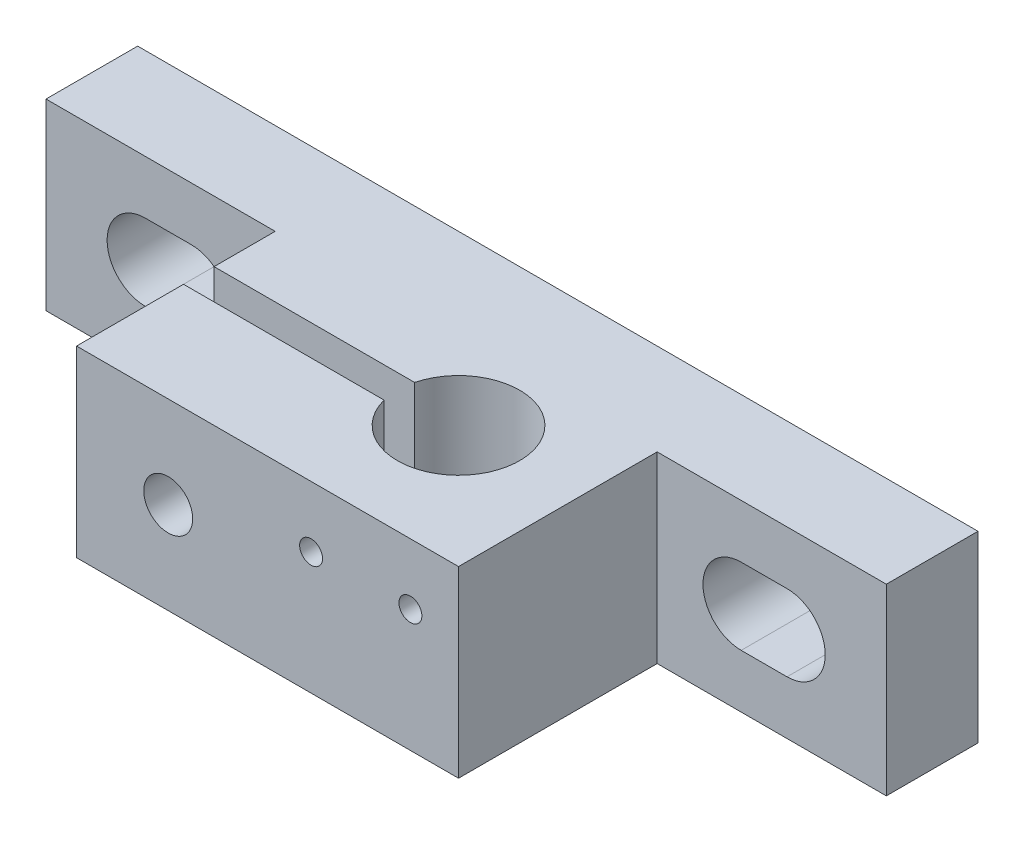
ISO-10303-21;
HEADER;
FILE_DESCRIPTION(('STEP AP214'),'2;1');
FILE_NAME('part.step','',(''),(''),'','','');
FILE_SCHEMA(('AUTOMOTIVE_DESIGN { 1 0 10303 214 1 1 1 1 }'));
ENDSEC;
DATA;
#1=APPLICATION_CONTEXT('core data for automotive mechanical design processes');
#2=APPLICATION_PROTOCOL_DEFINITION('international standard','automotive_design',2000,#1);
#3=PRODUCT_CONTEXT('',#1,'mechanical');
#4=PRODUCT('Part','Part','',(#3));
#5=PRODUCT_RELATED_PRODUCT_CATEGORY('part','',(#4));
#6=PRODUCT_DEFINITION_FORMATION('','',#4);
#7=PRODUCT_DEFINITION_CONTEXT('part definition',#1,'design');
#8=PRODUCT_DEFINITION('design','',#6,#7);
#9=PRODUCT_DEFINITION_SHAPE('','',#8);
#10=(LENGTH_UNIT() NAMED_UNIT(*) SI_UNIT(.MILLI.,.METRE.));
#11=(NAMED_UNIT(*) PLANE_ANGLE_UNIT() SI_UNIT($,.RADIAN.));
#12=(NAMED_UNIT(*) SI_UNIT($,.STERADIAN.) SOLID_ANGLE_UNIT());
#13=UNCERTAINTY_MEASURE_WITH_UNIT(LENGTH_MEASURE(1.E-05),#10,'distance_accuracy_value','');
#14=(GEOMETRIC_REPRESENTATION_CONTEXT(3) GLOBAL_UNCERTAINTY_ASSIGNED_CONTEXT((#13)) GLOBAL_UNIT_ASSIGNED_CONTEXT((#10,
#11,#12)) REPRESENTATION_CONTEXT('',''));
#15=CARTESIAN_POINT('',(0.,0.,0.));
#16=DIRECTION('',(0.,0.,1.));
#17=DIRECTION('',(1.,0.,0.));
#18=AXIS2_PLACEMENT_3D('',#15,#16,#17);
#19=CARTESIAN_POINT('',(15.,0.,19.));
#20=DIRECTION('',(1.,0.,0.));
#21=DIRECTION('',(0.,0.,-1.));
#22=AXIS2_PLACEMENT_3D('',#19,#20,#21);
#23=PLANE('',#22);
#24=DIRECTION('',(0.,0.,-1.));
#25=VECTOR('',#24,1.);
#26=CARTESIAN_POINT('',(15.,0.,19.));
#27=LINE('',#26,#25);
#28=CARTESIAN_POINT('',(15.,0.,10.));
#29=VERTEX_POINT('',#28);
#30=CARTESIAN_POINT('',(15.,0.,6.));
#31=VERTEX_POINT('',#30);
#32=EDGE_CURVE('E375',#29,#31,#27,.T.);
#33=ORIENTED_EDGE('',*,*,#32,.F.);
#34=DIRECTION('',(0.,1.,0.));
#35=VECTOR('',#34,1.);
#36=CARTESIAN_POINT('',(15.,0.,10.));
#37=LINE('',#36,#35);
#38=CARTESIAN_POINT('',(15.,12.,10.));
#39=VERTEX_POINT('',#38);
#40=EDGE_CURVE('E42',#29,#39,#37,.T.);
#41=ORIENTED_EDGE('',*,*,#40,.T.);
#42=DIRECTION('',(0.,0.,-1.));
#43=VECTOR('',#42,1.);
#44=CARTESIAN_POINT('',(15.,12.,19.));
#45=LINE('',#44,#43);
#46=CARTESIAN_POINT('',(15.,12.,6.));
#47=VERTEX_POINT('',#46);
#48=EDGE_CURVE('E358',#39,#47,#45,.T.);
#49=ORIENTED_EDGE('',*,*,#48,.T.);
#50=DIRECTION('',(0.,-1.,0.));
#51=VECTOR('',#50,1.);
#52=CARTESIAN_POINT('',(15.,0.,6.));
#53=LINE('',#52,#51);
#54=EDGE_CURVE('E347',#47,#31,#53,.T.);
#55=ORIENTED_EDGE('',*,*,#54,.T.);
#56=EDGE_LOOP('',(#33,#41,#49,#55));
#57=FACE_BOUND('',#56,.T.);
#58=ADVANCED_FACE('F33',(#57),#23,.F.);
#59=CARTESIAN_POINT('',(0.,0.,6.));
#60=DIRECTION('',(0.,0.,-1.));
#61=DIRECTION('',(-1.,0.,0.));
#62=AXIS2_PLACEMENT_3D('',#59,#60,#61);
#63=PLANE('',#62);
#64=CARTESIAN_POINT('',(6.5,6.,6.));
#65=DIRECTION('',(0.,0.,1.));
#66=DIRECTION('',(1.,0.,0.));
#67=AXIS2_PLACEMENT_3D('',#64,#65,#66);
#68=CIRCLE('',#67,2.50000000000001);
#69=CARTESIAN_POINT('',(6.5,8.5,6.));
#70=VERTEX_POINT('',#69);
#71=CARTESIAN_POINT('',(6.5,3.49999999999999,6.));
#72=VERTEX_POINT('',#71);
#73=EDGE_CURVE('E453',#70,#72,#68,.T.);
#74=ORIENTED_EDGE('',*,*,#73,.F.);
#75=DIRECTION('',(-1.,0.,0.));
#76=VECTOR('',#75,1.);
#77=CARTESIAN_POINT('',(6.5,8.5,6.));
#78=LINE('',#77,#76);
#79=CARTESIAN_POINT('',(9.5,8.5,6.));
#80=VERTEX_POINT('',#79);
#81=EDGE_CURVE('E449',#80,#70,#78,.T.);
#82=ORIENTED_EDGE('',*,*,#81,.F.);
#83=CARTESIAN_POINT('',(9.5,6.,6.));
#84=DIRECTION('',(0.,0.,1.));
#85=DIRECTION('',(1.,0.,0.));
#86=AXIS2_PLACEMENT_3D('',#83,#84,#85);
#87=CIRCLE('',#86,2.50000000000001);
#88=CARTESIAN_POINT('',(9.49999999999999,3.49999999999999,6.));
#89=VERTEX_POINT('',#88);
#90=EDGE_CURVE('E465',#89,#80,#87,.T.);
#91=ORIENTED_EDGE('',*,*,#90,.F.);
#92=DIRECTION('',(1.,0.,0.));
#93=VECTOR('',#92,1.);
#94=CARTESIAN_POINT('',(6.5,3.49999999999999,6.));
#95=LINE('',#94,#93);
#96=EDGE_CURVE('E468',#72,#89,#95,.T.);
#97=ORIENTED_EDGE('',*,*,#96,.F.);
#98=EDGE_LOOP('',(#74,#82,#91,#97));
#99=FACE_BOUND('',#98,.T.);
#100=ORIENTED_EDGE('',*,*,#54,.F.);
#101=DIRECTION('',(-1.,0.,0.));
#102=VECTOR('',#101,1.);
#103=CARTESIAN_POINT('',(0.,12.,6.));
#104=LINE('',#103,#102);
#105=CARTESIAN_POINT('',(0.,12.,6.));
#106=VERTEX_POINT('',#105);
#107=EDGE_CURVE('E394',#47,#106,#104,.T.);
#108=ORIENTED_EDGE('',*,*,#107,.T.);
#109=DIRECTION('',(0.,-1.,0.));
#110=VECTOR('',#109,1.);
#111=CARTESIAN_POINT('',(0.,0.,6.));
#112=LINE('',#111,#110);
#113=CARTESIAN_POINT('',(0.,0.,6.));
#114=VERTEX_POINT('',#113);
#115=EDGE_CURVE('E424',#106,#114,#112,.T.);
#116=ORIENTED_EDGE('',*,*,#115,.T.);
#117=DIRECTION('',(1.,0.,0.));
#118=VECTOR('',#117,1.);
#119=CARTESIAN_POINT('',(0.,0.,6.));
#120=LINE('',#119,#118);
#121=EDGE_CURVE('E404',#114,#31,#120,.T.);
#122=ORIENTED_EDGE('',*,*,#121,.T.);
#123=EDGE_LOOP('',(#100,#108,#116,#122));
#124=FACE_BOUND('',#123,.T.);
#125=ADVANCED_FACE('F534',(#99,#124),#63,.F.);
#126=CARTESIAN_POINT('',(48.5,6.00000000000001,6.));
#127=DIRECTION('',(0.,0.,1.));
#128=DIRECTION('',(-1.,0.,0.));
#129=AXIS2_PLACEMENT_3D('',#126,#127,#128);
#130=CIRCLE('',#129,2.50000000000001);
#131=CARTESIAN_POINT('',(48.5,3.49999999999999,6.));
#132=VERTEX_POINT('',#131);
#133=CARTESIAN_POINT('',(48.5,8.50000000000001,6.));
#134=VERTEX_POINT('',#133);
#135=EDGE_CURVE('E484',#132,#134,#130,.T.);
#136=ORIENTED_EDGE('',*,*,#135,.F.);
#137=DIRECTION('',(1.,0.,0.));
#138=VECTOR('',#137,1.);
#139=CARTESIAN_POINT('',(48.5,3.49999999999999,6.));
#140=LINE('',#139,#138);
#141=CARTESIAN_POINT('',(45.5,3.49999999999999,6.));
#142=VERTEX_POINT('',#141);
#143=EDGE_CURVE('E480',#142,#132,#140,.T.);
#144=ORIENTED_EDGE('',*,*,#143,.F.);
#145=CARTESIAN_POINT('',(45.5,6.,6.));
#146=DIRECTION('',(0.,0.,1.));
#147=DIRECTION('',(-1.,0.,0.));
#148=AXIS2_PLACEMENT_3D('',#145,#146,#147);
#149=CIRCLE('',#148,2.50000000000001);
#150=CARTESIAN_POINT('',(45.5,8.50000000000001,6.));
#151=VERTEX_POINT('',#150);
#152=EDGE_CURVE('E496',#151,#142,#149,.T.);
#153=ORIENTED_EDGE('',*,*,#152,.F.);
#154=DIRECTION('',(-1.,0.,0.));
#155=VECTOR('',#154,1.);
#156=CARTESIAN_POINT('',(48.5,8.50000000000001,6.));
#157=LINE('',#156,#155);
#158=EDGE_CURVE('E499',#134,#151,#157,.T.);
#159=ORIENTED_EDGE('',*,*,#158,.F.);
#160=EDGE_LOOP('',(#136,#144,#153,#159));
#161=FACE_BOUND('',#160,.T.);
#162=DIRECTION('',(0.,1.,0.));
#163=VECTOR('',#162,1.);
#164=CARTESIAN_POINT('',(40.,0.,6.));
#165=LINE('',#164,#163);
#166=CARTESIAN_POINT('',(40.,0.,6.));
#167=VERTEX_POINT('',#166);
#168=CARTESIAN_POINT('',(40.,12.,6.));
#169=VERTEX_POINT('',#168);
#170=EDGE_CURVE('E352',#167,#169,#165,.T.);
#171=ORIENTED_EDGE('',*,*,#170,.F.);
#172=CARTESIAN_POINT('',(55.,0.,6.));
#173=VERTEX_POINT('',#172);
#174=EDGE_CURVE('E435',#167,#173,#120,.T.);
#175=ORIENTED_EDGE('',*,*,#174,.T.);
#176=DIRECTION('',(0.,1.,0.));
#177=VECTOR('',#176,1.);
#178=CARTESIAN_POINT('',(55.,0.,6.));
#179=LINE('',#178,#177);
#180=CARTESIAN_POINT('',(55.,12.,6.));
#181=VERTEX_POINT('',#180);
#182=EDGE_CURVE('E401',#173,#181,#179,.T.);
#183=ORIENTED_EDGE('',*,*,#182,.T.);
#184=EDGE_CURVE('E400',#181,#169,#104,.T.);
#185=ORIENTED_EDGE('',*,*,#184,.T.);
#186=EDGE_LOOP('',(#171,#175,#183,#185));
#187=FACE_BOUND('',#186,.T.);
#188=ADVANCED_FACE('F512',(#161,#187),#63,.F.);
#189=CARTESIAN_POINT('',(0.,0.,0.));
#190=DIRECTION('',(0.,0.,-1.));
#191=DIRECTION('',(-1.,0.,0.));
#192=AXIS2_PLACEMENT_3D('',#189,#190,#191);
#193=PLANE('',#192);
#194=DIRECTION('',(0.,-1.,0.));
#195=VECTOR('',#194,1.);
#196=CARTESIAN_POINT('',(37.6724189772482,9.5,0.));
#197=LINE('',#196,#195);
#198=CARTESIAN_POINT('',(37.6724189772482,9.5,0.));
#199=VERTEX_POINT('',#198);
#200=CARTESIAN_POINT('',(37.6724189772482,2.5,0.));
#201=VERTEX_POINT('',#200);
#202=EDGE_CURVE('E57',#199,#201,#197,.T.);
#203=ORIENTED_EDGE('',*,*,#202,.F.);
#204=DIRECTION('',(1.,0.,0.));
#205=VECTOR('',#204,1.);
#206=CARTESIAN_POINT('',(37.6724189772482,9.5,0.));
#207=LINE('',#206,#205);
#208=CARTESIAN_POINT('',(17.15852847,9.5,0.));
#209=VERTEX_POINT('',#208);
#210=EDGE_CURVE('E303',#209,#199,#207,.T.);
#211=ORIENTED_EDGE('',*,*,#210,.F.);
#212=DIRECTION('',(0.,1.,0.));
#213=VECTOR('',#212,1.);
#214=CARTESIAN_POINT('',(17.15852847,9.5,0.));
#215=LINE('',#214,#213);
#216=CARTESIAN_POINT('',(17.15852847,2.5,0.));
#217=VERTEX_POINT('',#216);
#218=EDGE_CURVE('E317',#217,#209,#215,.T.);
#219=ORIENTED_EDGE('',*,*,#218,.F.);
#220=DIRECTION('',(-1.,0.,0.));
#221=VECTOR('',#220,1.);
#222=CARTESIAN_POINT('',(37.6724189772482,2.5,0.));
#223=LINE('',#222,#221);
#224=EDGE_CURVE('E314',#201,#217,#223,.T.);
#225=ORIENTED_EDGE('',*,*,#224,.F.);
#226=EDGE_LOOP('',(#203,#211,#219,#225));
#227=FACE_BOUND('',#226,.T.);
#228=DIRECTION('',(-1.,0.,0.));
#229=VECTOR('',#228,1.);
#230=CARTESIAN_POINT('',(6.5,8.5,0.));
#231=LINE('',#230,#229);
#232=CARTESIAN_POINT('',(9.5,8.5,0.));
#233=VERTEX_POINT('',#232);
#234=CARTESIAN_POINT('',(6.5,8.5,0.));
#235=VERTEX_POINT('',#234);
#236=EDGE_CURVE('E450',#233,#235,#231,.T.);
#237=ORIENTED_EDGE('',*,*,#236,.T.);
#238=CARTESIAN_POINT('',(6.5,6.,0.));
#239=DIRECTION('',(0.,0.,1.));
#240=DIRECTION('',(1.,0.,0.));
#241=AXIS2_PLACEMENT_3D('',#238,#239,#240);
#242=CIRCLE('',#241,2.50000000000001);
#243=CARTESIAN_POINT('',(6.5,3.49999999999999,0.));
#244=VERTEX_POINT('',#243);
#245=EDGE_CURVE('E460',#235,#244,#242,.T.);
#246=ORIENTED_EDGE('',*,*,#245,.T.);
#247=DIRECTION('',(1.,0.,0.));
#248=VECTOR('',#247,1.);
#249=CARTESIAN_POINT('',(6.5,3.49999999999999,0.));
#250=LINE('',#249,#248);
#251=CARTESIAN_POINT('',(9.49999999999999,3.49999999999999,0.));
#252=VERTEX_POINT('',#251);
#253=EDGE_CURVE('E457',#244,#252,#250,.T.);
#254=ORIENTED_EDGE('',*,*,#253,.T.);
#255=CARTESIAN_POINT('',(9.5,6.,0.));
#256=DIRECTION('',(0.,0.,1.));
#257=DIRECTION('',(1.,0.,0.));
#258=AXIS2_PLACEMENT_3D('',#255,#256,#257);
#259=CIRCLE('',#258,2.50000000000001);
#260=EDGE_CURVE('E454',#252,#233,#259,.T.);
#261=ORIENTED_EDGE('',*,*,#260,.T.);
#262=EDGE_LOOP('',(#237,#246,#254,#261));
#263=FACE_BOUND('',#262,.T.);
#264=DIRECTION('',(0.,-1.,0.));
#265=VECTOR('',#264,1.);
#266=CARTESIAN_POINT('',(0.,0.,0.));
#267=LINE('',#266,#265);
#268=CARTESIAN_POINT('',(0.,12.,0.));
#269=VERTEX_POINT('',#268);
#270=CARTESIAN_POINT('',(0.,0.,0.));
#271=VERTEX_POINT('',#270);
#272=EDGE_CURVE('E413',#269,#271,#267,.T.);
#273=ORIENTED_EDGE('',*,*,#272,.F.);
#274=DIRECTION('',(-1.,0.,0.));
#275=VECTOR('',#274,1.);
#276=CARTESIAN_POINT('',(0.,12.,0.));
#277=LINE('',#276,#275);
#278=CARTESIAN_POINT('',(55.,12.,0.));
#279=VERTEX_POINT('',#278);
#280=EDGE_CURVE('E422',#279,#269,#277,.T.);
#281=ORIENTED_EDGE('',*,*,#280,.F.);
#282=DIRECTION('',(0.,1.,0.));
#283=VECTOR('',#282,1.);
#284=CARTESIAN_POINT('',(55.,0.,0.));
#285=LINE('',#284,#283);
#286=CARTESIAN_POINT('',(55.,0.,0.));
#287=VERTEX_POINT('',#286);
#288=EDGE_CURVE('E420',#287,#279,#285,.T.);
#289=ORIENTED_EDGE('',*,*,#288,.F.);
#290=DIRECTION('',(1.,0.,0.));
#291=VECTOR('',#290,1.);
#292=CARTESIAN_POINT('',(0.,0.,0.));
#293=LINE('',#292,#291);
#294=EDGE_CURVE('E417',#271,#287,#293,.T.);
#295=ORIENTED_EDGE('',*,*,#294,.F.);
#296=EDGE_LOOP('',(#273,#281,#289,#295));
#297=FACE_BOUND('',#296,.T.);
#298=DIRECTION('',(1.,0.,0.));
#299=VECTOR('',#298,1.);
#300=CARTESIAN_POINT('',(48.5,3.49999999999999,0.));
#301=LINE('',#300,#299);
#302=CARTESIAN_POINT('',(45.5,3.5,0.));
#303=VERTEX_POINT('',#302);
#304=CARTESIAN_POINT('',(48.5,3.49999999999999,0.));
#305=VERTEX_POINT('',#304);
#306=EDGE_CURVE('E481',#303,#305,#301,.T.);
#307=ORIENTED_EDGE('',*,*,#306,.T.);
#308=CARTESIAN_POINT('',(48.5,6.00000000000001,0.));
#309=DIRECTION('',(0.,0.,1.));
#310=DIRECTION('',(-1.,0.,0.));
#311=AXIS2_PLACEMENT_3D('',#308,#309,#310);
#312=CIRCLE('',#311,2.50000000000001);
#313=CARTESIAN_POINT('',(48.5,8.50000000000001,0.));
#314=VERTEX_POINT('',#313);
#315=EDGE_CURVE('E491',#305,#314,#312,.T.);
#316=ORIENTED_EDGE('',*,*,#315,.T.);
#317=DIRECTION('',(-1.,0.,0.));
#318=VECTOR('',#317,1.);
#319=CARTESIAN_POINT('',(48.5,8.50000000000001,0.));
#320=LINE('',#319,#318);
#321=CARTESIAN_POINT('',(45.5,8.50000000000001,0.));
#322=VERTEX_POINT('',#321);
#323=EDGE_CURVE('E488',#314,#322,#320,.T.);
#324=ORIENTED_EDGE('',*,*,#323,.T.);
#325=CARTESIAN_POINT('',(45.5,6.,0.));
#326=DIRECTION('',(0.,0.,1.));
#327=DIRECTION('',(-1.,0.,0.));
#328=AXIS2_PLACEMENT_3D('',#325,#326,#327);
#329=CIRCLE('',#328,2.50000000000001);
#330=EDGE_CURVE('E485',#322,#303,#329,.T.);
#331=ORIENTED_EDGE('',*,*,#330,.T.);
#332=EDGE_LOOP('',(#307,#316,#324,#331));
#333=FACE_BOUND('',#332,.T.);
#334=ADVANCED_FACE('F519',(#227,#263,#297,#333),#193,.T.);
#335=CARTESIAN_POINT('',(0.,0.,6.));
#336=DIRECTION('',(1.,0.,0.));
#337=DIRECTION('',(0.,0.,-1.));
#338=AXIS2_PLACEMENT_3D('',#335,#336,#337);
#339=PLANE('',#338);
#340=ORIENTED_EDGE('',*,*,#272,.T.);
#341=DIRECTION('',(0.,0.,-1.));
#342=VECTOR('',#341,1.);
#343=CARTESIAN_POINT('',(0.,0.,6.));
#344=LINE('',#343,#342);
#345=EDGE_CURVE('E382',#114,#271,#344,.T.);
#346=ORIENTED_EDGE('',*,*,#345,.F.);
#347=ORIENTED_EDGE('',*,*,#115,.F.);
#348=DIRECTION('',(0.,0.,-1.));
#349=VECTOR('',#348,1.);
#350=CARTESIAN_POINT('',(0.,12.,6.));
#351=LINE('',#350,#349);
#352=EDGE_CURVE('E396',#106,#269,#351,.T.);
#353=ORIENTED_EDGE('',*,*,#352,.T.);
#354=EDGE_LOOP('',(#340,#346,#347,#353));
#355=FACE_BOUND('',#354,.T.);
#356=ADVANCED_FACE('F35',(#355),#339,.F.);
#357=CARTESIAN_POINT('',(0.,0.,6.));
#358=DIRECTION('',(0.,1.,0.));
#359=DIRECTION('',(0.,0.,1.));
#360=AXIS2_PLACEMENT_3D('',#357,#358,#359);
#361=PLANE('',#360);
#362=CARTESIAN_POINT('',(32.,0.,11.));
#363=DIRECTION('',(0.,-1.,0.));
#364=DIRECTION('',(0.,0.,-1.));
#365=AXIS2_PLACEMENT_3D('',#362,#363,#364);
#366=CIRCLE('',#365,4.);
#367=CARTESIAN_POINT('',(28.1270166537926,0.,10.));
#368=VERTEX_POINT('',#367);
#369=CARTESIAN_POINT('',(28.1270166537926,0.,12.));
#370=VERTEX_POINT('',#369);
#371=EDGE_CURVE('E332',#368,#370,#366,.T.);
#372=ORIENTED_EDGE('',*,*,#371,.F.);
#373=DIRECTION('',(1.,0.,0.));
#374=VECTOR('',#373,1.);
#375=CARTESIAN_POINT('',(0.,0.,10.));
#376=LINE('',#375,#374);
#377=EDGE_CURVE('E324',#29,#368,#376,.T.);
#378=ORIENTED_EDGE('',*,*,#377,.F.);
#379=ORIENTED_EDGE('',*,*,#32,.T.);
#380=ORIENTED_EDGE('',*,*,#121,.F.);
#381=ORIENTED_EDGE('',*,*,#345,.T.);
#382=ORIENTED_EDGE('',*,*,#294,.T.);
#383=DIRECTION('',(0.,0.,-1.));
#384=VECTOR('',#383,1.);
#385=CARTESIAN_POINT('',(55.,0.,6.));
#386=LINE('',#385,#384);
#387=EDGE_CURVE('E429',#173,#287,#386,.T.);
#388=ORIENTED_EDGE('',*,*,#387,.F.);
#389=ORIENTED_EDGE('',*,*,#174,.F.);
#390=DIRECTION('',(0.,0.,-1.));
#391=VECTOR('',#390,1.);
#392=CARTESIAN_POINT('',(40.,0.,19.));
#393=LINE('',#392,#391);
#394=CARTESIAN_POINT('',(40.,0.,19.));
#395=VERTEX_POINT('',#394);
#396=EDGE_CURVE('E647',#395,#167,#393,.T.);
#397=ORIENTED_EDGE('',*,*,#396,.F.);
#398=DIRECTION('',(1.,0.,0.));
#399=VECTOR('',#398,1.);
#400=CARTESIAN_POINT('',(15.,0.,19.));
#401=LINE('',#400,#399);
#402=CARTESIAN_POINT('',(15.,0.,19.));
#403=VERTEX_POINT('',#402);
#404=EDGE_CURVE('E351',#403,#395,#401,.T.);
#405=ORIENTED_EDGE('',*,*,#404,.F.);
#406=CARTESIAN_POINT('',(15.,0.,12.));
#407=VERTEX_POINT('',#406);
#408=EDGE_CURVE('E494',#403,#407,#27,.T.);
#409=ORIENTED_EDGE('',*,*,#408,.T.);
#410=DIRECTION('',(-1.,0.,0.));
#411=VECTOR('',#410,1.);
#412=CARTESIAN_POINT('',(0.,0.,12.));
#413=LINE('',#412,#411);
#414=EDGE_CURVE('E335',#370,#407,#413,.T.);
#415=ORIENTED_EDGE('',*,*,#414,.F.);
#416=EDGE_LOOP('',(#372,#378,#379,#380,#381,#382,#388,#389,#397,#405,#409,#415));
#417=FACE_BOUND('',#416,.T.);
#418=ADVANCED_FACE('F662',(#417),#361,.F.);
#419=CARTESIAN_POINT('',(55.,0.,6.));
#420=DIRECTION('',(-1.,0.,0.));
#421=DIRECTION('',(0.,0.,1.));
#422=AXIS2_PLACEMENT_3D('',#419,#420,#421);
#423=PLANE('',#422);
#424=ORIENTED_EDGE('',*,*,#288,.T.);
#425=DIRECTION('',(0.,0.,-1.));
#426=VECTOR('',#425,1.);
#427=CARTESIAN_POINT('',(55.,12.,6.));
#428=LINE('',#427,#426);
#429=EDGE_CURVE('E426',#181,#279,#428,.T.);
#430=ORIENTED_EDGE('',*,*,#429,.F.);
#431=ORIENTED_EDGE('',*,*,#182,.F.);
#432=ORIENTED_EDGE('',*,*,#387,.T.);
#433=EDGE_LOOP('',(#424,#430,#431,#432));
#434=FACE_BOUND('',#433,.T.);
#435=ADVANCED_FACE('F667',(#434),#423,.F.);
#436=CARTESIAN_POINT('',(0.,12.,6.));
#437=DIRECTION('',(0.,-1.,0.));
#438=DIRECTION('',(0.,0.,-1.));
#439=AXIS2_PLACEMENT_3D('',#436,#437,#438);
#440=PLANE('',#439);
#441=ORIENTED_EDGE('',*,*,#48,.F.);
#442=DIRECTION('',(1.,0.,0.));
#443=VECTOR('',#442,1.);
#444=CARTESIAN_POINT('',(0.,12.,10.));
#445=LINE('',#444,#443);
#446=CARTESIAN_POINT('',(28.1270166537926,12.,10.));
#447=VERTEX_POINT('',#446);
#448=EDGE_CURVE('E344',#39,#447,#445,.T.);
#449=ORIENTED_EDGE('',*,*,#448,.T.);
#450=CARTESIAN_POINT('',(32.,12.,11.));
#451=DIRECTION('',(0.,-1.,0.));
#452=DIRECTION('',(0.,0.,-1.));
#453=AXIS2_PLACEMENT_3D('',#450,#451,#452);
#454=CIRCLE('',#453,4.);
#455=CARTESIAN_POINT('',(28.1270166537926,12.,12.));
#456=VERTEX_POINT('',#455);
#457=EDGE_CURVE('E11',#447,#456,#454,.T.);
#458=ORIENTED_EDGE('',*,*,#457,.T.);
#459=DIRECTION('',(-1.,0.,0.));
#460=VECTOR('',#459,1.);
#461=CARTESIAN_POINT('',(0.,12.,12.));
#462=LINE('',#461,#460);
#463=CARTESIAN_POINT('',(15.,12.,12.));
#464=VERTEX_POINT('',#463);
#465=EDGE_CURVE('E340',#456,#464,#462,.T.);
#466=ORIENTED_EDGE('',*,*,#465,.T.);
#467=CARTESIAN_POINT('',(15.,12.,19.));
#468=VERTEX_POINT('',#467);
#469=EDGE_CURVE('E369',#468,#464,#45,.T.);
#470=ORIENTED_EDGE('',*,*,#469,.F.);
#471=DIRECTION('',(-1.,0.,0.));
#472=VECTOR('',#471,1.);
#473=CARTESIAN_POINT('',(15.,12.,19.));
#474=LINE('',#473,#472);
#475=CARTESIAN_POINT('',(40.,12.,19.));
#476=VERTEX_POINT('',#475);
#477=EDGE_CURVE('E356',#476,#468,#474,.T.);
#478=ORIENTED_EDGE('',*,*,#477,.F.);
#479=DIRECTION('',(0.,0.,-1.));
#480=VECTOR('',#479,1.);
#481=CARTESIAN_POINT('',(40.,12.,19.));
#482=LINE('',#481,#480);
#483=EDGE_CURVE('E372',#476,#169,#482,.T.);
#484=ORIENTED_EDGE('',*,*,#483,.T.);
#485=ORIENTED_EDGE('',*,*,#184,.F.);
#486=ORIENTED_EDGE('',*,*,#429,.T.);
#487=ORIENTED_EDGE('',*,*,#280,.T.);
#488=ORIENTED_EDGE('',*,*,#352,.F.);
#489=ORIENTED_EDGE('',*,*,#107,.F.);
#490=EDGE_LOOP('',(#441,#449,#458,#466,#470,#478,#484,#485,#486,#487,#488,#489));
#491=FACE_BOUND('',#490,.T.);
#492=ADVANCED_FACE('F392',(#491),#440,.F.);
#493=CARTESIAN_POINT('',(6.5,6.,6.));
#494=DIRECTION('',(0.,0.,-1.));
#495=DIRECTION('',(-1.,0.,0.));
#496=AXIS2_PLACEMENT_3D('',#493,#494,#495);
#497=CYLINDRICAL_SURFACE('',#496,2.50000000000001);
#498=ORIENTED_EDGE('',*,*,#245,.F.);
#499=DIRECTION('',(0.,0.,-1.));
#500=VECTOR('',#499,1.);
#501=CARTESIAN_POINT('',(6.5,8.5,6.));
#502=LINE('',#501,#500);
#503=EDGE_CURVE('E446',#70,#235,#502,.T.);
#504=ORIENTED_EDGE('',*,*,#503,.F.);
#505=ORIENTED_EDGE('',*,*,#73,.T.);
#506=DIRECTION('',(0.,0.,-1.));
#507=VECTOR('',#506,1.);
#508=CARTESIAN_POINT('',(6.5,3.49999999999999,6.));
#509=LINE('',#508,#507);
#510=EDGE_CURVE('E418',#72,#244,#509,.T.);
#511=ORIENTED_EDGE('',*,*,#510,.T.);
#512=EDGE_LOOP('',(#498,#504,#505,#511));
#513=FACE_BOUND('',#512,.T.);
#514=ADVANCED_FACE('F691',(#513),#497,.F.);
#515=CARTESIAN_POINT('',(6.5,3.49999999999999,6.));
#516=DIRECTION('',(0.,1.,0.));
#517=DIRECTION('',(0.,0.,1.));
#518=AXIS2_PLACEMENT_3D('',#515,#516,#517);
#519=PLANE('',#518);
#520=ORIENTED_EDGE('',*,*,#253,.F.);
#521=ORIENTED_EDGE('',*,*,#510,.F.);
#522=ORIENTED_EDGE('',*,*,#96,.T.);
#523=DIRECTION('',(0.,0.,-1.));
#524=VECTOR('',#523,1.);
#525=CARTESIAN_POINT('',(9.49999999999999,3.49999999999999,6.));
#526=LINE('',#525,#524);
#527=EDGE_CURVE('E442',#89,#252,#526,.T.);
#528=ORIENTED_EDGE('',*,*,#527,.T.);
#529=EDGE_LOOP('',(#520,#521,#522,#528));
#530=FACE_BOUND('',#529,.T.);
#531=ADVANCED_FACE('F708',(#530),#519,.T.);
#532=CARTESIAN_POINT('',(9.5,6.,6.));
#533=DIRECTION('',(0.,0.,-1.));
#534=DIRECTION('',(-1.,0.,0.));
#535=AXIS2_PLACEMENT_3D('',#532,#533,#534);
#536=CYLINDRICAL_SURFACE('',#535,2.50000000000001);
#537=ORIENTED_EDGE('',*,*,#260,.F.);
#538=ORIENTED_EDGE('',*,*,#527,.F.);
#539=ORIENTED_EDGE('',*,*,#90,.T.);
#540=DIRECTION('',(0.,0.,-1.));
#541=VECTOR('',#540,1.);
#542=CARTESIAN_POINT('',(9.5,8.5,6.));
#543=LINE('',#542,#541);
#544=EDGE_CURVE('E444',#80,#233,#543,.T.);
#545=ORIENTED_EDGE('',*,*,#544,.T.);
#546=EDGE_LOOP('',(#537,#538,#539,#545));
#547=FACE_BOUND('',#546,.T.);
#548=ADVANCED_FACE('F715',(#547),#536,.F.);
#549=CARTESIAN_POINT('',(6.5,8.5,6.));
#550=DIRECTION('',(0.,-1.,0.));
#551=DIRECTION('',(0.,0.,-1.));
#552=AXIS2_PLACEMENT_3D('',#549,#550,#551);
#553=PLANE('',#552);
#554=ORIENTED_EDGE('',*,*,#236,.F.);
#555=ORIENTED_EDGE('',*,*,#544,.F.);
#556=ORIENTED_EDGE('',*,*,#81,.T.);
#557=ORIENTED_EDGE('',*,*,#503,.T.);
#558=EDGE_LOOP('',(#554,#555,#556,#557));
#559=FACE_BOUND('',#558,.T.);
#560=ADVANCED_FACE('F723',(#559),#553,.T.);
#561=CARTESIAN_POINT('',(48.5,6.00000000000001,6.));
#562=DIRECTION('',(0.,0.,-1.));
#563=DIRECTION('',(-1.,0.,0.));
#564=AXIS2_PLACEMENT_3D('',#561,#562,#563);
#565=CYLINDRICAL_SURFACE('',#564,2.50000000000001);
#566=ORIENTED_EDGE('',*,*,#315,.F.);
#567=DIRECTION('',(0.,0.,-1.));
#568=VECTOR('',#567,1.);
#569=CARTESIAN_POINT('',(48.5,3.49999999999999,6.));
#570=LINE('',#569,#568);
#571=EDGE_CURVE('E477',#132,#305,#570,.T.);
#572=ORIENTED_EDGE('',*,*,#571,.F.);
#573=ORIENTED_EDGE('',*,*,#135,.T.);
#574=DIRECTION('',(0.,0.,-1.));
#575=VECTOR('',#574,1.);
#576=CARTESIAN_POINT('',(48.5,8.50000000000001,6.));
#577=LINE('',#576,#575);
#578=EDGE_CURVE('E463',#134,#314,#577,.T.);
#579=ORIENTED_EDGE('',*,*,#578,.T.);
#580=EDGE_LOOP('',(#566,#572,#573,#579));
#581=FACE_BOUND('',#580,.T.);
#582=ADVANCED_FACE('F504',(#581),#565,.F.);
#583=CARTESIAN_POINT('',(48.5,8.50000000000001,6.));
#584=DIRECTION('',(0.,-1.,0.));
#585=DIRECTION('',(0.,0.,-1.));
#586=AXIS2_PLACEMENT_3D('',#583,#584,#585);
#587=PLANE('',#586);
#588=ORIENTED_EDGE('',*,*,#323,.F.);
#589=ORIENTED_EDGE('',*,*,#578,.F.);
#590=ORIENTED_EDGE('',*,*,#158,.T.);
#591=DIRECTION('',(0.,0.,-1.));
#592=VECTOR('',#591,1.);
#593=CARTESIAN_POINT('',(45.5,8.50000000000001,6.));
#594=LINE('',#593,#592);
#595=EDGE_CURVE('E473',#151,#322,#594,.T.);
#596=ORIENTED_EDGE('',*,*,#595,.T.);
#597=EDGE_LOOP('',(#588,#589,#590,#596));
#598=FACE_BOUND('',#597,.T.);
#599=ADVANCED_FACE('F509',(#598),#587,.T.);
#600=CARTESIAN_POINT('',(45.5,6.,6.));
#601=DIRECTION('',(0.,0.,-1.));
#602=DIRECTION('',(-1.,0.,0.));
#603=AXIS2_PLACEMENT_3D('',#600,#601,#602);
#604=CYLINDRICAL_SURFACE('',#603,2.50000000000001);
#605=ORIENTED_EDGE('',*,*,#330,.F.);
#606=ORIENTED_EDGE('',*,*,#595,.F.);
#607=ORIENTED_EDGE('',*,*,#152,.T.);
#608=DIRECTION('',(0.,0.,-1.));
#609=VECTOR('',#608,1.);
#610=CARTESIAN_POINT('',(45.5,3.5,6.));
#611=LINE('',#610,#609);
#612=EDGE_CURVE('E475',#142,#303,#611,.T.);
#613=ORIENTED_EDGE('',*,*,#612,.T.);
#614=EDGE_LOOP('',(#605,#606,#607,#613));
#615=FACE_BOUND('',#614,.T.);
#616=ADVANCED_FACE('F516',(#615),#604,.F.);
#617=CARTESIAN_POINT('',(48.5,3.49999999999999,6.));
#618=DIRECTION('',(0.,1.,0.));
#619=DIRECTION('',(-1.,0.,0.));
#620=AXIS2_PLACEMENT_3D('',#617,#618,#619);
#621=PLANE('',#620);
#622=ORIENTED_EDGE('',*,*,#306,.F.);
#623=ORIENTED_EDGE('',*,*,#612,.F.);
#624=ORIENTED_EDGE('',*,*,#143,.T.);
#625=ORIENTED_EDGE('',*,*,#571,.T.);
#626=EDGE_LOOP('',(#622,#623,#624,#625));
#627=FACE_BOUND('',#626,.T.);
#628=ADVANCED_FACE('F521',(#627),#621,.T.);
#629=ORIENTED_EDGE('',*,*,#469,.T.);
#630=DIRECTION('',(0.,-1.,0.));
#631=VECTOR('',#630,1.);
#632=CARTESIAN_POINT('',(15.,0.,12.));
#633=LINE('',#632,#631);
#634=EDGE_CURVE('E379',#464,#407,#633,.T.);
#635=ORIENTED_EDGE('',*,*,#634,.T.);
#636=ORIENTED_EDGE('',*,*,#408,.F.);
#637=DIRECTION('',(0.,-1.,0.));
#638=VECTOR('',#637,1.);
#639=CARTESIAN_POINT('',(15.,0.,19.));
#640=LINE('',#639,#638);
#641=EDGE_CURVE('E348',#468,#403,#640,.T.);
#642=ORIENTED_EDGE('',*,*,#641,.F.);
#643=EDGE_LOOP('',(#629,#635,#636,#642));
#644=FACE_BOUND('',#643,.T.);
#645=ADVANCED_FACE('F523',(#644),#23,.F.);
#646=CARTESIAN_POINT('',(40.,0.,19.));
#647=DIRECTION('',(-1.,0.,0.));
#648=DIRECTION('',(0.,0.,1.));
#649=AXIS2_PLACEMENT_3D('',#646,#647,#648);
#650=PLANE('',#649);
#651=ORIENTED_EDGE('',*,*,#170,.T.);
#652=ORIENTED_EDGE('',*,*,#483,.F.);
#653=DIRECTION('',(0.,1.,0.));
#654=VECTOR('',#653,1.);
#655=CARTESIAN_POINT('',(40.,0.,19.));
#656=LINE('',#655,#654);
#657=EDGE_CURVE('E354',#395,#476,#656,.T.);
#658=ORIENTED_EDGE('',*,*,#657,.F.);
#659=ORIENTED_EDGE('',*,*,#396,.T.);
#660=EDGE_LOOP('',(#651,#652,#658,#659));
#661=FACE_BOUND('',#660,.T.);
#662=ADVANCED_FACE('F529',(#661),#650,.F.);
#663=CARTESIAN_POINT('',(0.,0.,19.));
#664=DIRECTION('',(0.,0.,-1.));
#665=DIRECTION('',(-1.,0.,0.));
#666=AXIS2_PLACEMENT_3D('',#663,#664,#665);
#667=PLANE('',#666);
#668=CARTESIAN_POINT('',(30.35,7.99999999999995,19.));
#669=DIRECTION('',(0.,0.,1.));
#670=DIRECTION('',(1.,0.,0.));
#671=AXIS2_PLACEMENT_3D('',#668,#669,#670);
#672=CIRCLE('',#671,0.749999999999999);
#673=CARTESIAN_POINT('',(31.1,7.99999999999995,19.));
#674=VERTEX_POINT('',#673);
#675=EDGE_CURVE('E626',#674,#674,#672,.T.);
#676=ORIENTED_EDGE('',*,*,#675,.F.);
#677=EDGE_LOOP('',(#676));
#678=FACE_BOUND('',#677,.T.);
#679=CARTESIAN_POINT('',(36.85,8.,19.));
#680=DIRECTION('',(0.,0.,1.));
#681=DIRECTION('',(1.,0.,0.));
#682=AXIS2_PLACEMENT_3D('',#679,#680,#681);
#683=CIRCLE('',#682,0.749999999999999);
#684=CARTESIAN_POINT('',(37.6,8.,19.));
#685=VERTEX_POINT('',#684);
#686=EDGE_CURVE('E259',#685,#685,#683,.T.);
#687=ORIENTED_EDGE('',*,*,#686,.F.);
#688=EDGE_LOOP('',(#687));
#689=FACE_BOUND('',#688,.T.);
#690=CARTESIAN_POINT('',(21.,6.,19.));
#691=DIRECTION('',(0.,0.,1.));
#692=DIRECTION('',(1.,0.,0.));
#693=AXIS2_PLACEMENT_3D('',#690,#691,#692);
#694=CIRCLE('',#693,1.6);
#695=CARTESIAN_POINT('',(22.6,6.,19.));
#696=VERTEX_POINT('',#695);
#697=EDGE_CURVE('E293',#696,#696,#694,.T.);
#698=ORIENTED_EDGE('',*,*,#697,.F.);
#699=EDGE_LOOP('',(#698));
#700=FACE_BOUND('',#699,.T.);
#701=ORIENTED_EDGE('',*,*,#641,.T.);
#702=ORIENTED_EDGE('',*,*,#404,.T.);
#703=ORIENTED_EDGE('',*,*,#657,.T.);
#704=ORIENTED_EDGE('',*,*,#477,.T.);
#705=EDGE_LOOP('',(#701,#702,#703,#704));
#706=FACE_BOUND('',#705,.T.);
#707=ADVANCED_FACE('F543',(#678,#689,#700,#706),#667,.F.);
#708=CARTESIAN_POINT('',(32.,30.,11.));
#709=DIRECTION('',(0.,-1.,0.));
#710=DIRECTION('',(0.,0.,-1.));
#711=AXIS2_PLACEMENT_3D('',#708,#709,#710);
#712=CYLINDRICAL_SURFACE('',#711,4.);
#713=DIRECTION('',(0.,-1.,0.));
#714=VECTOR('',#713,1.);
#715=CARTESIAN_POINT('',(28.1270166537926,30.,10.));
#716=LINE('',#715,#714);
#717=EDGE_CURVE('E337',#447,#368,#716,.T.);
#718=ORIENTED_EDGE('',*,*,#717,.T.);
#719=ORIENTED_EDGE('',*,*,#371,.T.);
#720=DIRECTION('',(0.,-1.,0.));
#721=VECTOR('',#720,1.);
#722=CARTESIAN_POINT('',(28.1270166537926,30.,12.));
#723=LINE('',#722,#721);
#724=EDGE_CURVE('E338',#456,#370,#723,.T.);
#725=ORIENTED_EDGE('',*,*,#724,.F.);
#726=ORIENTED_EDGE('',*,*,#457,.F.);
#727=EDGE_LOOP('',(#718,#719,#725,#726));
#728=FACE_BOUND('',#727,.T.);
#729=ADVANCED_FACE('F547',(#728),#712,.F.);
#730=CARTESIAN_POINT('',(0.,30.,10.));
#731=DIRECTION('',(0.,0.,-1.));
#732=DIRECTION('',(-1.,0.,0.));
#733=AXIS2_PLACEMENT_3D('',#730,#731,#732);
#734=PLANE('',#733);
#735=CARTESIAN_POINT('',(21.,6.,10.));
#736=DIRECTION('',(0.,0.,-1.));
#737=DIRECTION('',(-1.,0.,0.));
#738=AXIS2_PLACEMENT_3D('',#735,#736,#737);
#739=CIRCLE('',#738,1.6);
#740=CARTESIAN_POINT('',(19.4,6.,10.));
#741=VERTEX_POINT('',#740);
#742=EDGE_CURVE('E296',#741,#741,#739,.T.);
#743=ORIENTED_EDGE('',*,*,#742,.T.);
#744=EDGE_LOOP('',(#743));
#745=FACE_BOUND('',#744,.T.);
#746=ORIENTED_EDGE('',*,*,#40,.F.);
#747=ORIENTED_EDGE('',*,*,#377,.T.);
#748=ORIENTED_EDGE('',*,*,#717,.F.);
#749=ORIENTED_EDGE('',*,*,#448,.F.);
#750=EDGE_LOOP('',(#746,#747,#748,#749));
#751=FACE_BOUND('',#750,.T.);
#752=ADVANCED_FACE('F549',(#745,#751),#734,.F.);
#753=CARTESIAN_POINT('',(0.,30.,12.));
#754=DIRECTION('',(0.,0.,1.));
#755=DIRECTION('',(1.,0.,0.));
#756=AXIS2_PLACEMENT_3D('',#753,#754,#755);
#757=PLANE('',#756);
#758=CARTESIAN_POINT('',(21.,6.,12.));
#759=DIRECTION('',(0.,0.,1.));
#760=DIRECTION('',(1.,0.,0.));
#761=AXIS2_PLACEMENT_3D('',#758,#759,#760);
#762=CIRCLE('',#761,1.6);
#763=CARTESIAN_POINT('',(22.6,6.,12.));
#764=VERTEX_POINT('',#763);
#765=EDGE_CURVE('E37',#764,#764,#762,.T.);
#766=ORIENTED_EDGE('',*,*,#765,.T.);
#767=EDGE_LOOP('',(#766));
#768=FACE_BOUND('',#767,.T.);
#769=ORIENTED_EDGE('',*,*,#724,.T.);
#770=ORIENTED_EDGE('',*,*,#414,.T.);
#771=ORIENTED_EDGE('',*,*,#634,.F.);
#772=ORIENTED_EDGE('',*,*,#465,.F.);
#773=EDGE_LOOP('',(#769,#770,#771,#772));
#774=FACE_BOUND('',#773,.T.);
#775=ADVANCED_FACE('F552',(#768,#774),#757,.F.);
#776=CARTESIAN_POINT('',(37.6724189772482,9.5,5.));
#777=DIRECTION('',(1.,0.,0.));
#778=DIRECTION('',(0.,0.,-1.));
#779=AXIS2_PLACEMENT_3D('',#776,#777,#778);
#780=PLANE('',#779);
#781=ORIENTED_EDGE('',*,*,#202,.T.);
#782=DIRECTION('',(0.,0.,-1.));
#783=VECTOR('',#782,1.);
#784=CARTESIAN_POINT('',(37.6724189772482,2.5,5.));
#785=LINE('',#784,#783);
#786=CARTESIAN_POINT('',(37.6724189772482,2.5,5.));
#787=VERTEX_POINT('',#786);
#788=EDGE_CURVE('E312',#787,#201,#785,.T.);
#789=ORIENTED_EDGE('',*,*,#788,.F.);
#790=DIRECTION('',(0.,-1.,0.));
#791=VECTOR('',#790,1.);
#792=CARTESIAN_POINT('',(37.6724189772482,9.5,5.));
#793=LINE('',#792,#791);
#794=CARTESIAN_POINT('',(37.6724189772482,9.5,5.));
#795=VERTEX_POINT('',#794);
#796=EDGE_CURVE('E299',#795,#787,#793,.T.);
#797=ORIENTED_EDGE('',*,*,#796,.F.);
#798=DIRECTION('',(0.,0.,-1.));
#799=VECTOR('',#798,1.);
#800=CARTESIAN_POINT('',(37.6724189772482,9.5,5.));
#801=LINE('',#800,#799);
#802=EDGE_CURVE('E322',#795,#199,#801,.T.);
#803=ORIENTED_EDGE('',*,*,#802,.T.);
#804=EDGE_LOOP('',(#781,#789,#797,#803));
#805=FACE_BOUND('',#804,.T.);
#806=ADVANCED_FACE('F559',(#805),#780,.F.);
#807=CARTESIAN_POINT('',(37.6724189772482,9.5,5.));
#808=DIRECTION('',(0.,1.,0.));
#809=DIRECTION('',(-1.,0.,0.));
#810=AXIS2_PLACEMENT_3D('',#807,#808,#809);
#811=PLANE('',#810);
#812=ORIENTED_EDGE('',*,*,#210,.T.);
#813=ORIENTED_EDGE('',*,*,#802,.F.);
#814=DIRECTION('',(1.,0.,0.));
#815=VECTOR('',#814,1.);
#816=CARTESIAN_POINT('',(37.6724189772482,9.5,5.));
#817=LINE('',#816,#815);
#818=CARTESIAN_POINT('',(17.15852847,9.5,5.));
#819=VERTEX_POINT('',#818);
#820=EDGE_CURVE('E309',#819,#795,#817,.T.);
#821=ORIENTED_EDGE('',*,*,#820,.F.);
#822=DIRECTION('',(0.,0.,-1.));
#823=VECTOR('',#822,1.);
#824=CARTESIAN_POINT('',(17.15852847,9.5,5.));
#825=LINE('',#824,#823);
#826=EDGE_CURVE('E325',#819,#209,#825,.T.);
#827=ORIENTED_EDGE('',*,*,#826,.T.);
#828=EDGE_LOOP('',(#812,#813,#821,#827));
#829=FACE_BOUND('',#828,.T.);
#830=ADVANCED_FACE('F563',(#829),#811,.F.);
#831=CARTESIAN_POINT('',(17.15852847,9.5,5.));
#832=DIRECTION('',(-1.,0.,0.));
#833=DIRECTION('',(0.,0.,1.));
#834=AXIS2_PLACEMENT_3D('',#831,#832,#833);
#835=PLANE('',#834);
#836=ORIENTED_EDGE('',*,*,#218,.T.);
#837=ORIENTED_EDGE('',*,*,#826,.F.);
#838=DIRECTION('',(0.,1.,0.));
#839=VECTOR('',#838,1.);
#840=CARTESIAN_POINT('',(17.15852847,9.5,5.));
#841=LINE('',#840,#839);
#842=CARTESIAN_POINT('',(17.15852847,2.5,5.));
#843=VERTEX_POINT('',#842);
#844=EDGE_CURVE('E306',#843,#819,#841,.T.);
#845=ORIENTED_EDGE('',*,*,#844,.F.);
#846=DIRECTION('',(0.,0.,-1.));
#847=VECTOR('',#846,1.);
#848=CARTESIAN_POINT('',(17.15852847,2.5,5.));
#849=LINE('',#848,#847);
#850=EDGE_CURVE('E327',#843,#217,#849,.T.);
#851=ORIENTED_EDGE('',*,*,#850,.T.);
#852=EDGE_LOOP('',(#836,#837,#845,#851));
#853=FACE_BOUND('',#852,.T.);
#854=ADVANCED_FACE('F568',(#853),#835,.F.);
#855=CARTESIAN_POINT('',(37.6724189772482,2.5,5.));
#856=DIRECTION('',(0.,-1.,0.));
#857=DIRECTION('',(1.,0.,0.));
#858=AXIS2_PLACEMENT_3D('',#855,#856,#857);
#859=PLANE('',#858);
#860=ORIENTED_EDGE('',*,*,#224,.T.);
#861=ORIENTED_EDGE('',*,*,#850,.F.);
#862=DIRECTION('',(-1.,0.,0.));
#863=VECTOR('',#862,1.);
#864=CARTESIAN_POINT('',(37.6724189772482,2.5,5.));
#865=LINE('',#864,#863);
#866=EDGE_CURVE('E302',#787,#843,#865,.T.);
#867=ORIENTED_EDGE('',*,*,#866,.F.);
#868=ORIENTED_EDGE('',*,*,#788,.T.);
#869=EDGE_LOOP('',(#860,#861,#867,#868));
#870=FACE_BOUND('',#869,.T.);
#871=ADVANCED_FACE('F564',(#870),#859,.F.);
#872=CARTESIAN_POINT('',(0.,0.,5.));
#873=DIRECTION('',(0.,0.,-1.));
#874=DIRECTION('',(-1.,0.,0.));
#875=AXIS2_PLACEMENT_3D('',#872,#873,#874);
#876=PLANE('',#875);
#877=DIRECTION('',(-0.5,0.866025403784439,0.));
#878=VECTOR('',#877,1.);
#879=CARTESIAN_POINT('',(19.2679491924311,2.99999999999999,5.));
#880=LINE('',#879,#878);
#881=CARTESIAN_POINT('',(19.2679491924311,2.99999999999999,5.));
#882=VERTEX_POINT('',#881);
#883=CARTESIAN_POINT('',(17.5358983848622,6.,5.));
#884=VERTEX_POINT('',#883);
#885=EDGE_CURVE('E49',#882,#884,#880,.T.);
#886=ORIENTED_EDGE('',*,*,#885,.F.);
#887=DIRECTION('',(-1.,0.,0.));
#888=VECTOR('',#887,1.);
#889=CARTESIAN_POINT('',(22.7320508075689,2.99999999999999,5.));
#890=LINE('',#889,#888);
#891=CARTESIAN_POINT('',(22.7320508075689,2.99999999999999,5.));
#892=VERTEX_POINT('',#891);
#893=EDGE_CURVE('E253',#892,#882,#890,.T.);
#894=ORIENTED_EDGE('',*,*,#893,.F.);
#895=DIRECTION('',(-0.5,-0.866025403784438,0.));
#896=VECTOR('',#895,1.);
#897=CARTESIAN_POINT('',(24.4641016151378,6.,5.));
#898=LINE('',#897,#896);
#899=CARTESIAN_POINT('',(24.4641016151378,6.,5.));
#900=VERTEX_POINT('',#899);
#901=EDGE_CURVE('E256',#900,#892,#898,.T.);
#902=ORIENTED_EDGE('',*,*,#901,.F.);
#903=DIRECTION('',(0.5,-0.866025403784439,0.));
#904=VECTOR('',#903,1.);
#905=CARTESIAN_POINT('',(22.7320508075689,9.00000000000001,5.));
#906=LINE('',#905,#904);
#907=CARTESIAN_POINT('',(22.7320508075689,9.00000000000001,5.));
#908=VERTEX_POINT('',#907);
#909=EDGE_CURVE('E276',#908,#900,#906,.T.);
#910=ORIENTED_EDGE('',*,*,#909,.F.);
#911=DIRECTION('',(1.,0.,0.));
#912=VECTOR('',#911,1.);
#913=CARTESIAN_POINT('',(19.2679491924311,9.00000000000001,5.));
#914=LINE('',#913,#912);
#915=CARTESIAN_POINT('',(19.2679491924311,9.00000000000001,5.));
#916=VERTEX_POINT('',#915);
#917=EDGE_CURVE('E273',#916,#908,#914,.T.);
#918=ORIENTED_EDGE('',*,*,#917,.F.);
#919=DIRECTION('',(0.499999999999999,0.866025403784439,0.));
#920=VECTOR('',#919,1.);
#921=CARTESIAN_POINT('',(17.5358983848622,6.,5.));
#922=LINE('',#921,#920);
#923=EDGE_CURVE('E270',#884,#916,#922,.T.);
#924=ORIENTED_EDGE('',*,*,#923,.F.);
#925=EDGE_LOOP('',(#886,#894,#902,#910,#918,#924));
#926=FACE_BOUND('',#925,.T.);
#927=ORIENTED_EDGE('',*,*,#796,.T.);
#928=ORIENTED_EDGE('',*,*,#866,.T.);
#929=ORIENTED_EDGE('',*,*,#844,.T.);
#930=ORIENTED_EDGE('',*,*,#820,.T.);
#931=EDGE_LOOP('',(#927,#928,#929,#930));
#932=FACE_BOUND('',#931,.T.);
#933=ADVANCED_FACE('F567',(#926,#932),#876,.T.);
#934=CARTESIAN_POINT('',(21.,6.,8.));
#935=DIRECTION('',(0.,0.,1.));
#936=DIRECTION('',(1.,0.,0.));
#937=AXIS2_PLACEMENT_3D('',#934,#935,#936);
#938=CYLINDRICAL_SURFACE('',#937,1.6);
#939=ORIENTED_EDGE('',*,*,#697,.T.);
#940=EDGE_LOOP('',(#939));
#941=FACE_BOUND('',#940,.T.);
#942=ORIENTED_EDGE('',*,*,#765,.F.);
#943=EDGE_LOOP('',(#942));
#944=FACE_BOUND('',#943,.T.);
#945=ADVANCED_FACE('F578',(#941,#944),#938,.F.);
#946=CARTESIAN_POINT('',(21.,6.,8.));
#947=DIRECTION('',(0.,0.,-1.));
#948=DIRECTION('',(-1.,0.,0.));
#949=AXIS2_PLACEMENT_3D('',#946,#947,#948);
#950=CIRCLE('',#949,1.6);
#951=CARTESIAN_POINT('',(19.4,6.,8.));
#952=VERTEX_POINT('',#951);
#953=EDGE_CURVE('E283',#952,#952,#950,.F.);
#954=ORIENTED_EDGE('',*,*,#953,.F.);
#955=EDGE_LOOP('',(#954));
#956=FACE_BOUND('',#955,.T.);
#957=ORIENTED_EDGE('',*,*,#742,.F.);
#958=EDGE_LOOP('',(#957));
#959=FACE_BOUND('',#958,.T.);
#960=ADVANCED_FACE('F580',(#956,#959),#938,.F.);
#961=CARTESIAN_POINT('',(0.,0.,8.));
#962=DIRECTION('',(0.,0.,-1.));
#963=DIRECTION('',(-1.,0.,0.));
#964=AXIS2_PLACEMENT_3D('',#961,#962,#963);
#965=PLANE('',#964);
#966=DIRECTION('',(-0.5,0.866025403784439,0.));
#967=VECTOR('',#966,1.);
#968=CARTESIAN_POINT('',(19.2679491924311,2.99999999999999,8.));
#969=LINE('',#968,#967);
#970=CARTESIAN_POINT('',(19.2679491924311,2.99999999999999,8.));
#971=VERTEX_POINT('',#970);
#972=CARTESIAN_POINT('',(17.5358983848622,6.,8.));
#973=VERTEX_POINT('',#972);
#974=EDGE_CURVE('E233',#971,#973,#969,.T.);
#975=ORIENTED_EDGE('',*,*,#974,.T.);
#976=DIRECTION('',(0.499999999999999,0.866025403784439,0.));
#977=VECTOR('',#976,1.);
#978=CARTESIAN_POINT('',(17.5358983848622,6.,8.));
#979=LINE('',#978,#977);
#980=CARTESIAN_POINT('',(19.2679491924311,9.00000000000001,8.));
#981=VERTEX_POINT('',#980);
#982=EDGE_CURVE('E242',#973,#981,#979,.T.);
#983=ORIENTED_EDGE('',*,*,#982,.T.);
#984=DIRECTION('',(1.,0.,0.));
#985=VECTOR('',#984,1.);
#986=CARTESIAN_POINT('',(19.2679491924311,9.00000000000001,8.));
#987=LINE('',#986,#985);
#988=CARTESIAN_POINT('',(22.7320508075689,9.00000000000001,8.));
#989=VERTEX_POINT('',#988);
#990=EDGE_CURVE('E247',#981,#989,#987,.T.);
#991=ORIENTED_EDGE('',*,*,#990,.T.);
#992=DIRECTION('',(0.5,-0.866025403784439,0.));
#993=VECTOR('',#992,1.);
#994=CARTESIAN_POINT('',(22.7320508075689,9.00000000000001,8.));
#995=LINE('',#994,#993);
#996=CARTESIAN_POINT('',(24.4641016151378,6.,8.));
#997=VERTEX_POINT('',#996);
#998=EDGE_CURVE('E263',#989,#997,#995,.T.);
#999=ORIENTED_EDGE('',*,*,#998,.T.);
#1000=DIRECTION('',(-0.5,-0.866025403784438,0.));
#1001=VECTOR('',#1000,1.);
#1002=CARTESIAN_POINT('',(24.4641016151378,6.,8.));
#1003=LINE('',#1002,#1001);
#1004=CARTESIAN_POINT('',(22.7320508075689,2.99999999999999,8.));
#1005=VERTEX_POINT('',#1004);
#1006=EDGE_CURVE('E266',#997,#1005,#1003,.T.);
#1007=ORIENTED_EDGE('',*,*,#1006,.T.);
#1008=DIRECTION('',(-1.,0.,0.));
#1009=VECTOR('',#1008,1.);
#1010=CARTESIAN_POINT('',(22.7320508075689,2.99999999999999,8.));
#1011=LINE('',#1010,#1009);
#1012=EDGE_CURVE('E239',#1005,#971,#1011,.T.);
#1013=ORIENTED_EDGE('',*,*,#1012,.T.);
#1014=EDGE_LOOP('',(#975,#983,#991,#999,#1007,#1013));
#1015=FACE_BOUND('',#1014,.T.);
#1016=ORIENTED_EDGE('',*,*,#953,.T.);
#1017=EDGE_LOOP('',(#1016));
#1018=FACE_BOUND('',#1017,.T.);
#1019=ADVANCED_FACE('F249',(#1015,#1018),#965,.T.);
#1020=CARTESIAN_POINT('',(19.2679491924311,2.99999999999999,8.));
#1021=DIRECTION('',(-0.866025403784439,-0.5,0.));
#1022=DIRECTION('',(0.5,-0.866025403784439,0.));
#1023=AXIS2_PLACEMENT_3D('',#1020,#1021,#1022);
#1024=PLANE('',#1023);
#1025=ORIENTED_EDGE('',*,*,#885,.T.);
#1026=DIRECTION('',(0.,0.,-1.));
#1027=VECTOR('',#1026,1.);
#1028=CARTESIAN_POINT('',(17.5358983848622,6.,8.));
#1029=LINE('',#1028,#1027);
#1030=EDGE_CURVE('E229',#973,#884,#1029,.T.);
#1031=ORIENTED_EDGE('',*,*,#1030,.F.);
#1032=ORIENTED_EDGE('',*,*,#974,.F.);
#1033=DIRECTION('',(0.,0.,-1.));
#1034=VECTOR('',#1033,1.);
#1035=CARTESIAN_POINT('',(19.2679491924311,2.99999999999999,8.));
#1036=LINE('',#1035,#1034);
#1037=EDGE_CURVE('E281',#971,#882,#1036,.T.);
#1038=ORIENTED_EDGE('',*,*,#1037,.T.);
#1039=EDGE_LOOP('',(#1025,#1031,#1032,#1038));
#1040=FACE_BOUND('',#1039,.T.);
#1041=ADVANCED_FACE('F231',(#1040),#1024,.F.);
#1042=CARTESIAN_POINT('',(22.7320508075689,2.99999999999999,8.));
#1043=DIRECTION('',(0.,-1.,0.));
#1044=DIRECTION('',(0.,0.,-1.));
#1045=AXIS2_PLACEMENT_3D('',#1042,#1043,#1044);
#1046=PLANE('',#1045);
#1047=ORIENTED_EDGE('',*,*,#893,.T.);
#1048=ORIENTED_EDGE('',*,*,#1037,.F.);
#1049=ORIENTED_EDGE('',*,*,#1012,.F.);
#1050=DIRECTION('',(0.,0.,-1.));
#1051=VECTOR('',#1050,1.);
#1052=CARTESIAN_POINT('',(22.7320508075689,2.99999999999999,8.));
#1053=LINE('',#1052,#1051);
#1054=EDGE_CURVE('E284',#1005,#892,#1053,.T.);
#1055=ORIENTED_EDGE('',*,*,#1054,.T.);
#1056=EDGE_LOOP('',(#1047,#1048,#1049,#1055));
#1057=FACE_BOUND('',#1056,.T.);
#1058=ADVANCED_FACE('F586',(#1057),#1046,.F.);
#1059=CARTESIAN_POINT('',(24.4641016151378,6.,8.));
#1060=DIRECTION('',(0.866025403784439,-0.5,0.));
#1061=DIRECTION('',(0.5,0.866025403784439,0.));
#1062=AXIS2_PLACEMENT_3D('',#1059,#1060,#1061);
#1063=PLANE('',#1062);
#1064=ORIENTED_EDGE('',*,*,#901,.T.);
#1065=ORIENTED_EDGE('',*,*,#1054,.F.);
#1066=ORIENTED_EDGE('',*,*,#1006,.F.);
#1067=DIRECTION('',(0.,0.,-1.));
#1068=VECTOR('',#1067,1.);
#1069=CARTESIAN_POINT('',(24.4641016151378,6.,8.));
#1070=LINE('',#1069,#1068);
#1071=EDGE_CURVE('E286',#997,#900,#1070,.T.);
#1072=ORIENTED_EDGE('',*,*,#1071,.T.);
#1073=EDGE_LOOP('',(#1064,#1065,#1066,#1072));
#1074=FACE_BOUND('',#1073,.T.);
#1075=ADVANCED_FACE('F597',(#1074),#1063,.F.);
#1076=CARTESIAN_POINT('',(22.7320508075689,9.00000000000001,8.));
#1077=DIRECTION('',(0.866025403784439,0.5,0.));
#1078=DIRECTION('',(-0.5,0.866025403784439,0.));
#1079=AXIS2_PLACEMENT_3D('',#1076,#1077,#1078);
#1080=PLANE('',#1079);
#1081=ORIENTED_EDGE('',*,*,#909,.T.);
#1082=ORIENTED_EDGE('',*,*,#1071,.F.);
#1083=ORIENTED_EDGE('',*,*,#998,.F.);
#1084=DIRECTION('',(0.,0.,-1.));
#1085=VECTOR('',#1084,1.);
#1086=CARTESIAN_POINT('',(22.7320508075689,9.00000000000001,8.));
#1087=LINE('',#1086,#1085);
#1088=EDGE_CURVE('E288',#989,#908,#1087,.T.);
#1089=ORIENTED_EDGE('',*,*,#1088,.T.);
#1090=EDGE_LOOP('',(#1081,#1082,#1083,#1089));
#1091=FACE_BOUND('',#1090,.T.);
#1092=ADVANCED_FACE('F593',(#1091),#1080,.F.);
#1093=CARTESIAN_POINT('',(19.2679491924311,9.00000000000001,8.));
#1094=DIRECTION('',(0.,1.,0.));
#1095=DIRECTION('',(0.,0.,1.));
#1096=AXIS2_PLACEMENT_3D('',#1093,#1094,#1095);
#1097=PLANE('',#1096);
#1098=ORIENTED_EDGE('',*,*,#917,.T.);
#1099=ORIENTED_EDGE('',*,*,#1088,.F.);
#1100=ORIENTED_EDGE('',*,*,#990,.F.);
#1101=DIRECTION('',(0.,0.,-1.));
#1102=VECTOR('',#1101,1.);
#1103=CARTESIAN_POINT('',(19.2679491924311,9.00000000000001,8.));
#1104=LINE('',#1103,#1102);
#1105=EDGE_CURVE('E238',#981,#916,#1104,.T.);
#1106=ORIENTED_EDGE('',*,*,#1105,.T.);
#1107=EDGE_LOOP('',(#1098,#1099,#1100,#1106));
#1108=FACE_BOUND('',#1107,.T.);
#1109=ADVANCED_FACE('F590',(#1108),#1097,.F.);
#1110=CARTESIAN_POINT('',(17.5358983848622,6.,8.));
#1111=DIRECTION('',(-0.866025403784439,0.5,0.));
#1112=DIRECTION('',(-0.5,-0.866025403784439,0.));
#1113=AXIS2_PLACEMENT_3D('',#1110,#1111,#1112);
#1114=PLANE('',#1113);
#1115=ORIENTED_EDGE('',*,*,#923,.T.);
#1116=ORIENTED_EDGE('',*,*,#1105,.F.);
#1117=ORIENTED_EDGE('',*,*,#982,.F.);
#1118=ORIENTED_EDGE('',*,*,#1030,.T.);
#1119=EDGE_LOOP('',(#1115,#1116,#1117,#1118));
#1120=FACE_BOUND('',#1119,.T.);
#1121=ADVANCED_FACE('F243',(#1120),#1114,.F.);
#1122=CARTESIAN_POINT('',(36.85,8.,16.));
#1123=DIRECTION('',(0.,0.,1.));
#1124=DIRECTION('',(1.,0.,0.));
#1125=AXIS2_PLACEMENT_3D('',#1122,#1123,#1124);
#1126=CYLINDRICAL_SURFACE('',#1125,0.749999999999999);
#1127=CARTESIAN_POINT('',(36.85,8.,16.));
#1128=DIRECTION('',(0.,0.,1.));
#1129=DIRECTION('',(1.,0.,0.));
#1130=AXIS2_PLACEMENT_3D('',#1127,#1128,#1129);
#1131=CIRCLE('',#1130,0.749999999999999);
#1132=CARTESIAN_POINT('',(37.6,8.,16.));
#1133=VERTEX_POINT('',#1132);
#1134=EDGE_CURVE('E271',#1133,#1133,#1131,.T.);
#1135=ORIENTED_EDGE('',*,*,#1134,.F.);
#1136=EDGE_LOOP('',(#1135));
#1137=FACE_BOUND('',#1136,.T.);
#1138=ORIENTED_EDGE('',*,*,#686,.T.);
#1139=EDGE_LOOP('',(#1138));
#1140=FACE_BOUND('',#1139,.T.);
#1141=ADVANCED_FACE('F589',(#1137,#1140),#1126,.F.);
#1142=CARTESIAN_POINT('',(36.85,8.,16.));
#1143=DIRECTION('',(0.,0.,1.));
#1144=DIRECTION('',(1.,0.,0.));
#1145=AXIS2_PLACEMENT_3D('',#1142,#1143,#1144);
#1146=PLANE('',#1145);
#1147=ORIENTED_EDGE('',*,*,#1134,.T.);
#1148=EDGE_LOOP('',(#1147));
#1149=FACE_BOUND('',#1148,.T.);
#1150=ADVANCED_FACE('F609',(#1149),#1146,.T.);
#1151=CARTESIAN_POINT('',(30.35,7.99999999999995,16.));
#1152=DIRECTION('',(0.,0.,1.));
#1153=DIRECTION('',(1.,0.,0.));
#1154=AXIS2_PLACEMENT_3D('',#1151,#1152,#1153);
#1155=CYLINDRICAL_SURFACE('',#1154,0.749999999999999);
#1156=CARTESIAN_POINT('',(30.35,7.99999999999995,16.));
#1157=DIRECTION('',(0.,0.,1.));
#1158=DIRECTION('',(1.,0.,0.));
#1159=AXIS2_PLACEMENT_3D('',#1156,#1157,#1158);
#1160=CIRCLE('',#1159,0.749999999999999);
#1161=CARTESIAN_POINT('',(31.1,7.99999999999995,16.));
#1162=VERTEX_POINT('',#1161);
#1163=EDGE_CURVE('E625',#1162,#1162,#1160,.T.);
#1164=ORIENTED_EDGE('',*,*,#1163,.F.);
#1165=EDGE_LOOP('',(#1164));
#1166=FACE_BOUND('',#1165,.T.);
#1167=ORIENTED_EDGE('',*,*,#675,.T.);
#1168=EDGE_LOOP('',(#1167));
#1169=FACE_BOUND('',#1168,.T.);
#1170=ADVANCED_FACE('F613',(#1166,#1169),#1155,.F.);
#1171=CARTESIAN_POINT('',(30.35,7.99999999999995,16.));
#1172=DIRECTION('',(0.,0.,1.));
#1173=DIRECTION('',(1.,0.,0.));
#1174=AXIS2_PLACEMENT_3D('',#1171,#1172,#1173);
#1175=PLANE('',#1174);
#1176=ORIENTED_EDGE('',*,*,#1163,.T.);
#1177=EDGE_LOOP('',(#1176));
#1178=FACE_BOUND('',#1177,.T.);
#1179=ADVANCED_FACE('F617',(#1178),#1175,.T.);
#1180=CLOSED_SHELL('',(#58,#125,#188,#334,#356,#418,#435,#492,#514,#531,#548,#560,#582,#599,
#616,#628,#645,#662,#707,#729,#752,#775,#806,#830,#854,#871,#933,#945,#960,#1019,#1041,#1058,
#1075,#1092,#1109,#1121,#1141,#1150,#1170,#1179));
#1181=MANIFOLD_SOLID_BREP('B2',#1180);
#1182=ADVANCED_BREP_SHAPE_REPRESENTATION('',(#18,#1181),#14);
#1183=SHAPE_DEFINITION_REPRESENTATION(#9,#1182);
ENDSEC;
END-ISO-10303-21;
